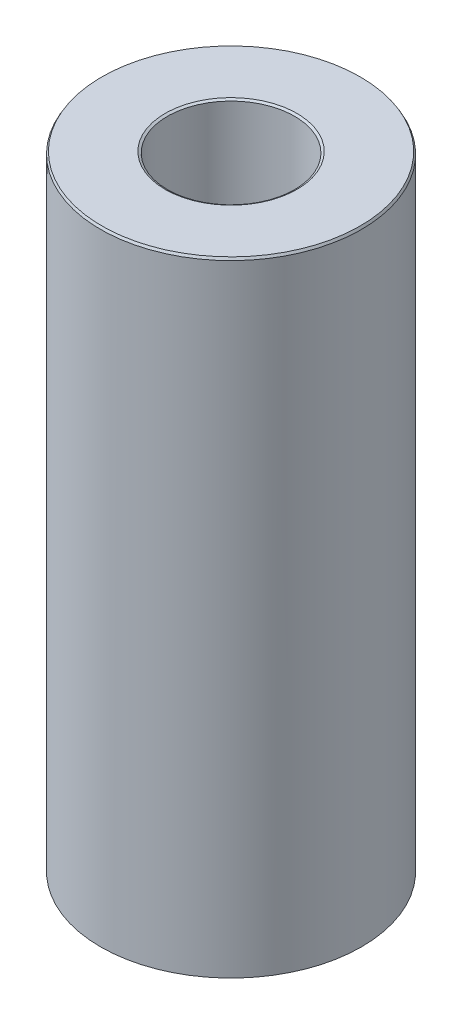
ISO-10303-21;
HEADER;
FILE_DESCRIPTION(('STEP AP214'),'2;1');
FILE_NAME('part.step','',(''),(''),'','','');
FILE_SCHEMA(('AUTOMOTIVE_DESIGN { 1 0 10303 214 1 1 1 1 }'));
ENDSEC;
DATA;
#1=APPLICATION_CONTEXT('core data for automotive mechanical design processes');
#2=APPLICATION_PROTOCOL_DEFINITION('international standard','automotive_design',2000,#1);
#3=PRODUCT_CONTEXT('',#1,'mechanical');
#4=PRODUCT('Part','Part','',(#3));
#5=PRODUCT_RELATED_PRODUCT_CATEGORY('part','',(#4));
#6=PRODUCT_DEFINITION_FORMATION('','',#4);
#7=PRODUCT_DEFINITION_CONTEXT('part definition',#1,'design');
#8=PRODUCT_DEFINITION('design','',#6,#7);
#9=PRODUCT_DEFINITION_SHAPE('','',#8);
#10=(LENGTH_UNIT() NAMED_UNIT(*) SI_UNIT(.MILLI.,.METRE.));
#11=(NAMED_UNIT(*) PLANE_ANGLE_UNIT() SI_UNIT($,.RADIAN.));
#12=(NAMED_UNIT(*) SI_UNIT($,.STERADIAN.) SOLID_ANGLE_UNIT());
#13=UNCERTAINTY_MEASURE_WITH_UNIT(LENGTH_MEASURE(1.E-05),#10,'distance_accuracy_value','');
#14=(GEOMETRIC_REPRESENTATION_CONTEXT(3) GLOBAL_UNCERTAINTY_ASSIGNED_CONTEXT((#13)) GLOBAL_UNIT_ASSIGNED_CONTEXT((#10,
#11,#12)) REPRESENTATION_CONTEXT('',''));
#15=CARTESIAN_POINT('',(0.,0.,0.));
#16=DIRECTION('',(0.,0.,1.));
#17=DIRECTION('',(1.,0.,0.));
#18=AXIS2_PLACEMENT_3D('',#15,#16,#17);
#19=CARTESIAN_POINT('',(0.,251.429332052384,0.));
#20=DIRECTION('',(0.,-1.,0.));
#21=DIRECTION('',(0.,0.,-1.));
#22=AXIS2_PLACEMENT_3D('',#19,#20,#21);
#23=CYLINDRICAL_SURFACE('',#22,52.5);
#24=CARTESIAN_POINT('',(0.,0.538346103388876,0.));
#25=DIRECTION('',(0.,1.,0.));
#26=DIRECTION('',(0.,0.,1.));
#27=AXIS2_PLACEMENT_3D('',#24,#25,#26);
#28=CIRCLE('',#27,52.5);
#29=CARTESIAN_POINT('',(0.,0.538346103388876,52.5));
#30=VERTEX_POINT('',#29);
#31=EDGE_CURVE('E10',#30,#30,#28,.T.);
#32=ORIENTED_EDGE('',*,*,#31,.T.);
#33=EDGE_LOOP('',(#32));
#34=FACE_BOUND('',#33,.T.);
#35=CARTESIAN_POINT('',(0.,250.496889249257,0.));
#36=DIRECTION('',(0.,1.,0.));
#37=DIRECTION('',(0.,0.,1.));
#38=AXIS2_PLACEMENT_3D('',#35,#36,#37);
#39=CIRCLE('',#38,52.5);
#40=CARTESIAN_POINT('',(0.,250.496889249257,-52.5));
#41=VERTEX_POINT('',#40);
#42=EDGE_CURVE('E50',#41,#41,#39,.F.);
#43=ORIENTED_EDGE('',*,*,#42,.T.);
#44=EDGE_LOOP('',(#43));
#45=FACE_BOUND('',#44,.T.);
#46=ADVANCED_FACE('F39',(#34,#45),#23,.T.);
#47=CARTESIAN_POINT('',(0.,251.429332052384,0.));
#48=DIRECTION('',(0.,1.,0.));
#49=DIRECTION('',(0.,0.,1.));
#50=AXIS2_PLACEMENT_3D('',#47,#48,#49);
#51=PLANE('',#50);
#52=CARTESIAN_POINT('',(0.,251.429332052384,0.));
#53=DIRECTION('',(0.,1.,0.));
#54=DIRECTION('',(0.,0.,1.));
#55=AXIS2_PLACEMENT_3D('',#52,#53,#54);
#56=CIRCLE('',#55,26.5108227550772);
#57=CARTESIAN_POINT('',(0.,251.429332052384,26.5108227550772));
#58=VERTEX_POINT('',#57);
#59=EDGE_CURVE('E58',#58,#58,#56,.F.);
#60=ORIENTED_EDGE('',*,*,#59,.T.);
#61=EDGE_LOOP('',(#60));
#62=FACE_BOUND('',#61,.T.);
#63=CARTESIAN_POINT('',(0.,251.429332052384,0.));
#64=DIRECTION('',(0.,1.,0.));
#65=DIRECTION('',(0.,0.,1.));
#66=AXIS2_PLACEMENT_3D('',#63,#64,#65);
#67=CIRCLE('',#66,51.9616538966111);
#68=CARTESIAN_POINT('',(0.,251.429332052384,-51.9616538966112));
#69=VERTEX_POINT('',#68);
#70=EDGE_CURVE('E61',#69,#69,#67,.T.);
#71=ORIENTED_EDGE('',*,*,#70,.T.);
#72=EDGE_LOOP('',(#71));
#73=FACE_BOUND('',#72,.T.);
#74=ADVANCED_FACE('F88',(#62,#73),#51,.T.);
#75=CARTESIAN_POINT('',(0.,0.,0.));
#76=DIRECTION('',(0.,1.,0.));
#77=DIRECTION('',(0.,0.,1.));
#78=AXIS2_PLACEMENT_3D('',#75,#76,#77);
#79=PLANE('',#78);
#80=CARTESIAN_POINT('',(0.,0.,0.));
#81=DIRECTION('',(0.,1.,0.));
#82=DIRECTION('',(0.,0.,1.));
#83=AXIS2_PLACEMENT_3D('',#80,#81,#82);
#84=CIRCLE('',#83,26.1167260553398);
#85=CARTESIAN_POINT('',(0.,0.,26.1167260553398));
#86=VERTEX_POINT('',#85);
#87=EDGE_CURVE('E51',#86,#86,#84,.T.);
#88=ORIENTED_EDGE('',*,*,#87,.T.);
#89=EDGE_LOOP('',(#88));
#90=FACE_BOUND('',#89,.T.);
#91=CARTESIAN_POINT('',(0.,0.,0.));
#92=DIRECTION('',(0.,1.,0.));
#93=DIRECTION('',(0.,0.,1.));
#94=AXIS2_PLACEMENT_3D('',#91,#92,#93);
#95=CIRCLE('',#94,51.5675571968738);
#96=CARTESIAN_POINT('',(0.,0.,51.5675571968738));
#97=VERTEX_POINT('',#96);
#98=EDGE_CURVE('E54',#97,#97,#95,.F.);
#99=ORIENTED_EDGE('',*,*,#98,.T.);
#100=EDGE_LOOP('',(#99));
#101=FACE_BOUND('',#100,.T.);
#102=ADVANCED_FACE('F83',(#90,#101),#79,.F.);
#103=CARTESIAN_POINT('',(0.,251.429332052384,0.));
#104=DIRECTION('',(0.,-1.,0.));
#105=DIRECTION('',(0.,0.,-1.));
#106=AXIS2_PLACEMENT_3D('',#103,#104,#105);
#107=CYLINDRICAL_SURFACE('',#106,25.5783799519509);
#108=CARTESIAN_POINT('',(0.,250.890985948995,0.));
#109=DIRECTION('',(0.,1.,0.));
#110=DIRECTION('',(0.,0.,1.));
#111=AXIS2_PLACEMENT_3D('',#108,#109,#110);
#112=CIRCLE('',#111,25.5783799519509);
#113=CARTESIAN_POINT('',(0.,250.890985948995,25.5783799519509));
#114=VERTEX_POINT('',#113);
#115=EDGE_CURVE('E67',#114,#114,#112,.T.);
#116=ORIENTED_EDGE('',*,*,#115,.T.);
#117=EDGE_LOOP('',(#116));
#118=FACE_BOUND('',#117,.T.);
#119=CARTESIAN_POINT('',(0.,0.932442803126321,0.));
#120=DIRECTION('',(0.,1.,0.));
#121=DIRECTION('',(0.,0.,1.));
#122=AXIS2_PLACEMENT_3D('',#119,#120,#121);
#123=CIRCLE('',#122,25.5783799519509);
#124=CARTESIAN_POINT('',(0.,0.932442803126321,25.5783799519509));
#125=VERTEX_POINT('',#124);
#126=EDGE_CURVE('E69',#125,#125,#123,.F.);
#127=ORIENTED_EDGE('',*,*,#126,.T.);
#128=EDGE_LOOP('',(#127));
#129=FACE_BOUND('',#128,.T.);
#130=ADVANCED_FACE('F71',(#118,#129),#107,.F.);
#131=CARTESIAN_POINT('',(0.,250.890985948995,0.));
#132=DIRECTION('',(0.,1.,0.));
#133=DIRECTION('',(0.,0.,1.));
#134=AXIS2_PLACEMENT_3D('',#131,#132,#133);
#135=CONICAL_SURFACE('',#134,25.5783799519509,1.04719755119658);
#136=ORIENTED_EDGE('',*,*,#59,.F.);
#137=EDGE_LOOP('',(#136));
#138=FACE_BOUND('',#137,.T.);
#139=ORIENTED_EDGE('',*,*,#115,.F.);
#140=EDGE_LOOP('',(#139));
#141=FACE_BOUND('',#140,.T.);
#142=ADVANCED_FACE('F77',(#138,#141),#135,.F.);
#143=CARTESIAN_POINT('',(0.,0.,0.));
#144=DIRECTION('',(0.,-1.,0.));
#145=DIRECTION('',(0.,0.,-1.));
#146=AXIS2_PLACEMENT_3D('',#143,#144,#145);
#147=CONICAL_SURFACE('',#146,26.1167260553398,0.523598775598299);
#148=ORIENTED_EDGE('',*,*,#126,.F.);
#149=EDGE_LOOP('',(#148));
#150=FACE_BOUND('',#149,.T.);
#151=ORIENTED_EDGE('',*,*,#87,.F.);
#152=EDGE_LOOP('',(#151));
#153=FACE_BOUND('',#152,.T.);
#154=ADVANCED_FACE('F73',(#150,#153),#147,.F.);
#155=CARTESIAN_POINT('',(0.,0.538346103388876,0.));
#156=DIRECTION('',(0.,1.,0.));
#157=DIRECTION('',(0.,0.,1.));
#158=AXIS2_PLACEMENT_3D('',#155,#156,#157);
#159=CONICAL_SURFACE('',#158,52.5,1.04719755119659);
#160=ORIENTED_EDGE('',*,*,#98,.F.);
#161=EDGE_LOOP('',(#160));
#162=FACE_BOUND('',#161,.T.);
#163=ORIENTED_EDGE('',*,*,#31,.F.);
#164=EDGE_LOOP('',(#163));
#165=FACE_BOUND('',#164,.T.);
#166=ADVANCED_FACE('F76',(#162,#165),#159,.T.);
#167=CARTESIAN_POINT('',(0.,251.429332052384,0.));
#168=DIRECTION('',(0.,-1.,0.));
#169=DIRECTION('',(0.,0.,-1.));
#170=AXIS2_PLACEMENT_3D('',#167,#168,#169);
#171=CONICAL_SURFACE('',#170,51.9616538966111,0.523598775598306);
#172=CARTESIAN_POINT('',(0.,250.496889249257,-52.5));
#173=CARTESIAN_POINT('',(0.,250.506602195123,-52.4943922280897));
#174=CARTESIAN_POINT('',(0.,250.516315140989,-52.4887844561794));
#175=CARTESIAN_POINT('',(0.,250.535741032721,-52.4775689123588));
#176=CARTESIAN_POINT('',(0.,250.545453978587,-52.4719611404485));
#177=CARTESIAN_POINT('',(0.,250.564879870319,-52.4607455966279));
#178=CARTESIAN_POINT('',(0.,250.574592816185,-52.4551378247176));
#179=CARTESIAN_POINT('',(0.,250.594018707916,-52.443922280897));
#180=CARTESIAN_POINT('',(0.,250.603731653782,-52.4383145089867));
#181=CARTESIAN_POINT('',(0.,250.623157545514,-52.4270989651661));
#182=CARTESIAN_POINT('',(0.,250.63287049138,-52.4214911932558));
#183=CARTESIAN_POINT('',(0.,250.652296383112,-52.4102756494352));
#184=CARTESIAN_POINT('',(0.,250.662009328978,-52.4046678775249));
#185=CARTESIAN_POINT('',(0.,250.68143522071,-52.3934523337043));
#186=CARTESIAN_POINT('',(0.,250.691148166575,-52.387844561794));
#187=CARTESIAN_POINT('',(0.,250.710574058307,-52.3766290179734));
#188=CARTESIAN_POINT('',(0.,250.720287004173,-52.3710212460631));
#189=CARTESIAN_POINT('',(0.,250.739712895905,-52.3598057022425));
#190=CARTESIAN_POINT('',(0.,250.749425841771,-52.3541979303322));
#191=CARTESIAN_POINT('',(0.,250.768851733503,-52.3429823865116));
#192=CARTESIAN_POINT('',(0.,250.778564679369,-52.3373746146013));
#193=CARTESIAN_POINT('',(0.,250.7979905711,-52.3261590707807));
#194=CARTESIAN_POINT('',(0.,250.807703516966,-52.3205512988704));
#195=CARTESIAN_POINT('',(0.,250.827129408698,-52.3093357550498));
#196=CARTESIAN_POINT('',(0.,250.836842354564,-52.3037279831395));
#197=CARTESIAN_POINT('',(0.,250.856268246296,-52.2925124393189));
#198=CARTESIAN_POINT('',(0.,250.865981192162,-52.2869046674086));
#199=CARTESIAN_POINT('',(0.,250.885407083893,-52.275689123588));
#200=CARTESIAN_POINT('',(0.,250.895120029759,-52.2700813516777));
#201=CARTESIAN_POINT('',(0.,250.914545921491,-52.2588658078571));
#202=CARTESIAN_POINT('',(0.,250.924258867357,-52.2532580359468));
#203=CARTESIAN_POINT('',(0.,250.943684759089,-52.2420424921262));
#204=CARTESIAN_POINT('',(0.,250.953397704955,-52.2364347202159));
#205=CARTESIAN_POINT('',(0.,250.972823596686,-52.2252191763953));
#206=CARTESIAN_POINT('',(0.,250.982536542552,-52.219611404485));
#207=CARTESIAN_POINT('',(0.,251.001962434284,-52.2083958606644));
#208=CARTESIAN_POINT('',(0.,251.01167538015,-52.2027880887541));
#209=CARTESIAN_POINT('',(0.,251.031101271882,-52.1915725449335));
#210=CARTESIAN_POINT('',(0.,251.040814217748,-52.1859647730232));
#211=CARTESIAN_POINT('',(0.,251.06024010948,-52.1747492292026));
#212=CARTESIAN_POINT('',(0.,251.069953055345,-52.1691414572923));
#213=CARTESIAN_POINT('',(0.,251.089378947077,-52.1579259134717));
#214=CARTESIAN_POINT('',(0.,251.099091892943,-52.1523181415614));
#215=CARTESIAN_POINT('',(0.,251.118517784675,-52.1411025977408));
#216=CARTESIAN_POINT('',(0.,251.128230730541,-52.1354948258305));
#217=CARTESIAN_POINT('',(0.,251.147656622273,-52.1242792820099));
#218=CARTESIAN_POINT('',(0.,251.157369568139,-52.1186715100996));
#219=CARTESIAN_POINT('',(0.,251.17679545987,-52.107455966279));
#220=CARTESIAN_POINT('',(0.,251.186508405736,-52.1018481943687));
#221=CARTESIAN_POINT('',(0.,251.205934297468,-52.0906326505481));
#222=CARTESIAN_POINT('',(0.,251.215647243334,-52.0850248786378));
#223=CARTESIAN_POINT('',(0.,251.235073135066,-52.0738093348172));
#224=CARTESIAN_POINT('',(0.,251.244786080932,-52.0682015629069));
#225=CARTESIAN_POINT('',(0.,251.264211972663,-52.0569860190863));
#226=CARTESIAN_POINT('',(0.,251.273924918529,-52.051378247176));
#227=CARTESIAN_POINT('',(0.,251.293350810261,-52.0401627033554));
#228=CARTESIAN_POINT('',(0.,251.303063756127,-52.0345549314451));
#229=CARTESIAN_POINT('',(0.,251.322489647859,-52.0233393876245));
#230=CARTESIAN_POINT('',(0.,251.332202593725,-52.0177316157142));
#231=CARTESIAN_POINT('',(0.,251.351628485457,-52.0065160718936));
#232=CARTESIAN_POINT('',(0.,251.361341431322,-52.0009082999833));
#233=CARTESIAN_POINT('',(0.,251.380767323054,-51.9896927561627));
#234=CARTESIAN_POINT('',(0.,251.39048026892,-51.9840849842524));
#235=CARTESIAN_POINT('',(0.,251.409906160652,-51.9728694404318));
#236=CARTESIAN_POINT('',(0.,251.419619106518,-51.9672616685215));
#237=CARTESIAN_POINT('',(0.,251.429332052384,-51.9616538966112));
#238=B_SPLINE_CURVE_WITH_KNOTS('',3,(#172,#173,#174,#175,#176,#177,#178,#179,#180,#181,#182,
#183,#184,#185,#186,#187,#188,#189,#190,#191,#192,#193,#194,#195,#196,#197,#198,#199,#200,#201,
#202,#203,#204,#205,#206,#207,#208,#209,#210,#211,#212,#213,#214,#215,#216,#217,#218,#219,#220,
#221,#222,#223,#224,#225,#226,#227,#228,#229,#230,#231,#232,#233,#234,#235,#236,#237),
.UNSPECIFIED.,.F.,.F.,(4,2,2,2,2,2,2,2,2,2,2,2,2,2,2,2,2,2,2,2,2,2,2,2,2,2,2,2,2,2,2,2,4),(0.,
0.0336466314618046,0.0672932629236093,0.100939894385417,0.134586525847222,0.16823315730903,
0.201879788770835,0.235526420232643,0.269173051694447,0.302819683156252,0.33646631461806,
0.370112946079865,0.403759577541673,0.437406209003478,0.471052840465282,0.50469947192709,
0.538346103388847,0.571992734850655,0.60563936631246,0.639285997774264,0.672932629236072,
0.706579260697877,0.740225892159685,0.77387252362149,0.807519155083294,0.841165786545103,
0.874812418006907,0.908459049468715,0.94210568093052,0.975752312392325,1.00939894385413,
1.04304557531594,1.07669220677775),.UNSPECIFIED.);
#239=EDGE_CURVE('BSEAM45',#41,#69,#238,.T.);
#240=ORIENTED_EDGE('',*,*,#42,.F.);
#241=ORIENTED_EDGE('',*,*,#70,.F.);
#242=ORIENTED_EDGE('',*,*,#239,.T.);
#243=ORIENTED_EDGE('',*,*,#239,.F.);
#244=EDGE_LOOP('',(#240,#242,#241,#243));
#245=FACE_BOUND('',#244,.T.);
#246=ADVANCED_FACE('F45',(#245),#171,.T.);
#247=CLOSED_SHELL('',(#46,#74,#102,#130,#142,#154,#166,#246));
#248=MANIFOLD_SOLID_BREP('B2',#247);
#249=ADVANCED_BREP_SHAPE_REPRESENTATION('',(#18,#248),#14);
#250=SHAPE_DEFINITION_REPRESENTATION(#9,#249);
ENDSEC;
END-ISO-10303-21;
